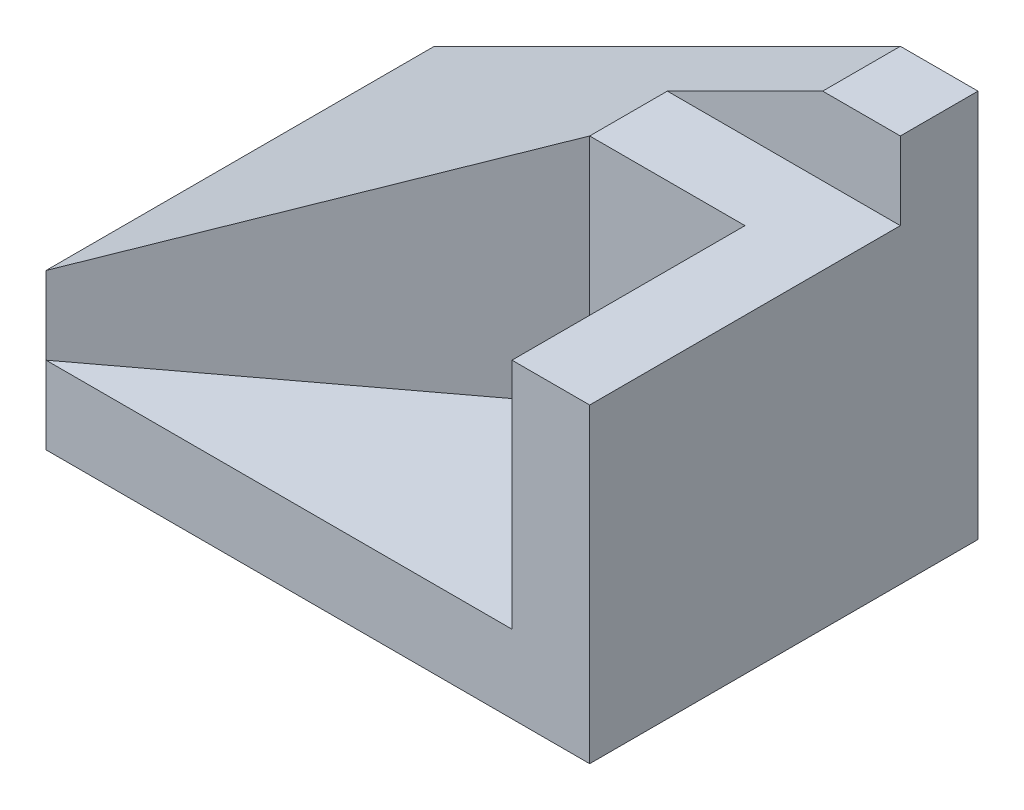
ISO-10303-21;
HEADER;
FILE_DESCRIPTION(('STEP AP214'),'2;1');
FILE_NAME('part.step','',(''),(''),'','','');
FILE_SCHEMA(('AUTOMOTIVE_DESIGN { 1 0 10303 214 1 1 1 1 }'));
ENDSEC;
DATA;
#1=APPLICATION_CONTEXT('core data for automotive mechanical design processes');
#2=APPLICATION_PROTOCOL_DEFINITION('international standard','automotive_design',2000,#1);
#3=PRODUCT_CONTEXT('',#1,'mechanical');
#4=PRODUCT('Part','Part','',(#3));
#5=PRODUCT_RELATED_PRODUCT_CATEGORY('part','',(#4));
#6=PRODUCT_DEFINITION_FORMATION('','',#4);
#7=PRODUCT_DEFINITION_CONTEXT('part definition',#1,'design');
#8=PRODUCT_DEFINITION('design','',#6,#7);
#9=PRODUCT_DEFINITION_SHAPE('','',#8);
#10=(LENGTH_UNIT() NAMED_UNIT(*) SI_UNIT(.MILLI.,.METRE.));
#11=(NAMED_UNIT(*) PLANE_ANGLE_UNIT() SI_UNIT($,.RADIAN.));
#12=(NAMED_UNIT(*) SI_UNIT($,.STERADIAN.) SOLID_ANGLE_UNIT());
#13=UNCERTAINTY_MEASURE_WITH_UNIT(LENGTH_MEASURE(1.E-05),#10,'distance_accuracy_value','');
#14=(GEOMETRIC_REPRESENTATION_CONTEXT(3) GLOBAL_UNCERTAINTY_ASSIGNED_CONTEXT((#13)) GLOBAL_UNIT_ASSIGNED_CONTEXT((#10,
#11,#12)) REPRESENTATION_CONTEXT('',''));
#15=CARTESIAN_POINT('',(0.,0.,0.));
#16=DIRECTION('',(0.,0.,1.));
#17=DIRECTION('',(1.,0.,0.));
#18=AXIS2_PLACEMENT_3D('',#15,#16,#17);
#19=CARTESIAN_POINT('',(0.,10.,20.));
#20=DIRECTION('',(0.,-1.,0.));
#21=DIRECTION('',(0.,0.,-1.));
#22=AXIS2_PLACEMENT_3D('',#19,#20,#21);
#23=PLANE('',#22);
#24=DIRECTION('',(-1.,0.,0.));
#25=VECTOR('',#24,1.);
#26=CARTESIAN_POINT('',(60.,10.,20.));
#27=LINE('',#26,#25);
#28=CARTESIAN_POINT('',(60.,10.,20.));
#29=VERTEX_POINT('',#28);
#30=CARTESIAN_POINT('',(40.,10.,20.));
#31=VERTEX_POINT('',#30);
#32=EDGE_CURVE('E171',#29,#31,#27,.T.);
#33=ORIENTED_EDGE('',*,*,#32,.T.);
#34=DIRECTION('',(0.8,0.,-0.6));
#35=VECTOR('',#34,1.);
#36=CARTESIAN_POINT('',(0.,10.,50.));
#37=LINE('',#36,#35);
#38=CARTESIAN_POINT('',(0.,10.,50.));
#39=VERTEX_POINT('',#38);
#40=EDGE_CURVE('E11',#39,#31,#37,.T.);
#41=ORIENTED_EDGE('',*,*,#40,.F.);
#42=DIRECTION('',(1.,0.,0.));
#43=VECTOR('',#42,1.);
#44=CARTESIAN_POINT('',(0.,10.,50.));
#45=LINE('',#44,#43);
#46=CARTESIAN_POINT('',(60.,10.,50.));
#47=VERTEX_POINT('',#46);
#48=EDGE_CURVE('E187',#39,#47,#45,.T.);
#49=ORIENTED_EDGE('',*,*,#48,.T.);
#50=DIRECTION('',(0.,0.,1.));
#51=VECTOR('',#50,1.);
#52=CARTESIAN_POINT('',(60.,10.,20.));
#53=LINE('',#52,#51);
#54=EDGE_CURVE('E126',#29,#47,#53,.T.);
#55=ORIENTED_EDGE('',*,*,#54,.F.);
#56=EDGE_LOOP('',(#33,#41,#49,#55));
#57=FACE_BOUND('',#56,.T.);
#58=ADVANCED_FACE('F33',(#57),#23,.F.);
#59=CARTESIAN_POINT('',(60.,50.,0.));
#60=DIRECTION('',(0.447213595499958,-0.894427190999916,0.));
#61=DIRECTION('',(0.894427190999916,0.447213595499958,0.));
#62=AXIS2_PLACEMENT_3D('',#59,#60,#61);
#63=PLANE('',#62);
#64=DIRECTION('',(0.,0.,1.));
#65=VECTOR('',#64,1.);
#66=CARTESIAN_POINT('',(0.,20.,0.));
#67=LINE('',#66,#65);
#68=CARTESIAN_POINT('',(0.,20.,0.));
#69=VERTEX_POINT('',#68);
#70=CARTESIAN_POINT('',(0.,20.,50.));
#71=VERTEX_POINT('',#70);
#72=EDGE_CURVE('E117',#69,#71,#67,.T.);
#73=ORIENTED_EDGE('',*,*,#72,.T.);
#74=DIRECTION('',(0.742781352708207,0.371390676354104,-0.557086014531156));
#75=VECTOR('',#74,1.);
#76=CARTESIAN_POINT('',(62.0689655172414,51.0344827586207,3.44827586206894));
#77=LINE('',#76,#75);
#78=CARTESIAN_POINT('',(40.,40.,20.));
#79=VERTEX_POINT('',#78);
#80=EDGE_CURVE('E104',#71,#79,#77,.T.);
#81=ORIENTED_EDGE('',*,*,#80,.T.);
#82=DIRECTION('',(0.,0.,-1.));
#83=VECTOR('',#82,1.);
#84=CARTESIAN_POINT('',(40.,40.,0.));
#85=LINE('',#84,#83);
#86=CARTESIAN_POINT('',(40.,40.,10.));
#87=VERTEX_POINT('',#86);
#88=EDGE_CURVE('E37',#79,#87,#85,.T.);
#89=ORIENTED_EDGE('',*,*,#88,.T.);
#90=DIRECTION('',(0.894427190999916,0.447213595499958,0.));
#91=VECTOR('',#90,1.);
#92=CARTESIAN_POINT('',(60.,50.,10.));
#93=LINE('',#92,#91);
#94=CARTESIAN_POINT('',(59.9999999999999,50.,10.));
#95=VERTEX_POINT('',#94);
#96=EDGE_CURVE('E132',#87,#95,#93,.T.);
#97=ORIENTED_EDGE('',*,*,#96,.T.);
#98=DIRECTION('',(0.,0.,1.));
#99=VECTOR('',#98,1.);
#100=CARTESIAN_POINT('',(60.,50.,0.));
#101=LINE('',#100,#99);
#102=CARTESIAN_POINT('',(60.,50.,0.));
#103=VERTEX_POINT('',#102);
#104=EDGE_CURVE('E158',#103,#95,#101,.T.);
#105=ORIENTED_EDGE('',*,*,#104,.F.);
#106=DIRECTION('',(0.894427190999916,0.447213595499958,0.));
#107=VECTOR('',#106,1.);
#108=CARTESIAN_POINT('',(60.,50.,0.));
#109=LINE('',#108,#107);
#110=EDGE_CURVE('E166',#69,#103,#109,.T.);
#111=ORIENTED_EDGE('',*,*,#110,.F.);
#112=EDGE_LOOP('',(#73,#81,#89,#97,#105,#111));
#113=FACE_BOUND('',#112,.T.);
#114=ADVANCED_FACE('F35',(#113),#63,.F.);
#115=CARTESIAN_POINT('',(20.,40.,50.));
#116=DIRECTION('',(0.,-1.,0.));
#117=DIRECTION('',(0.,0.,-1.));
#118=AXIS2_PLACEMENT_3D('',#115,#116,#117);
#119=PLANE('',#118);
#120=ORIENTED_EDGE('',*,*,#88,.F.);
#121=DIRECTION('',(-1.,0.,0.));
#122=VECTOR('',#121,1.);
#123=CARTESIAN_POINT('',(60.,40.,20.));
#124=LINE('',#123,#122);
#125=CARTESIAN_POINT('',(60.,40.,20.));
#126=VERTEX_POINT('',#125);
#127=EDGE_CURVE('E121',#126,#79,#124,.T.);
#128=ORIENTED_EDGE('',*,*,#127,.F.);
#129=DIRECTION('',(0.,0.,1.));
#130=VECTOR('',#129,1.);
#131=CARTESIAN_POINT('',(60.,40.,20.));
#132=LINE('',#131,#130);
#133=CARTESIAN_POINT('',(60.,40.,50.));
#134=VERTEX_POINT('',#133);
#135=EDGE_CURVE('E133',#126,#134,#132,.T.);
#136=ORIENTED_EDGE('',*,*,#135,.T.);
#137=DIRECTION('',(1.,0.,0.));
#138=VECTOR('',#137,1.);
#139=CARTESIAN_POINT('',(20.,40.,50.));
#140=LINE('',#139,#138);
#141=CARTESIAN_POINT('',(70.,40.,50.));
#142=VERTEX_POINT('',#141);
#143=EDGE_CURVE('E137',#134,#142,#140,.T.);
#144=ORIENTED_EDGE('',*,*,#143,.T.);
#145=DIRECTION('',(0.,0.,-1.));
#146=VECTOR('',#145,1.);
#147=CARTESIAN_POINT('',(70.,40.,50.));
#148=LINE('',#147,#146);
#149=CARTESIAN_POINT('',(70.,40.,10.));
#150=VERTEX_POINT('',#149);
#151=EDGE_CURVE('E162',#142,#150,#148,.T.);
#152=ORIENTED_EDGE('',*,*,#151,.T.);
#153=DIRECTION('',(1.,0.,0.));
#154=VECTOR('',#153,1.);
#155=CARTESIAN_POINT('',(20.,40.,10.));
#156=LINE('',#155,#154);
#157=EDGE_CURVE('E131',#87,#150,#156,.T.);
#158=ORIENTED_EDGE('',*,*,#157,.F.);
#159=EDGE_LOOP('',(#120,#128,#136,#144,#152,#158));
#160=FACE_BOUND('',#159,.T.);
#161=ADVANCED_FACE('F129',(#160),#119,.F.);
#162=CARTESIAN_POINT('',(0.,0.,50.));
#163=DIRECTION('',(1.,0.,0.));
#164=DIRECTION('',(0.,0.,-1.));
#165=AXIS2_PLACEMENT_3D('',#162,#163,#164);
#166=PLANE('',#165);
#167=DIRECTION('',(0.,-1.,0.));
#168=VECTOR('',#167,1.);
#169=CARTESIAN_POINT('',(0.,10.,50.));
#170=LINE('',#169,#168);
#171=EDGE_CURVE('E43',#71,#39,#170,.T.);
#172=ORIENTED_EDGE('',*,*,#171,.F.);
#173=ORIENTED_EDGE('',*,*,#72,.F.);
#174=DIRECTION('',(0.,-1.,0.));
#175=VECTOR('',#174,1.);
#176=CARTESIAN_POINT('',(0.,0.,0.));
#177=LINE('',#176,#175);
#178=CARTESIAN_POINT('',(0.,0.,0.));
#179=VERTEX_POINT('',#178);
#180=EDGE_CURVE('E160',#69,#179,#177,.T.);
#181=ORIENTED_EDGE('',*,*,#180,.T.);
#182=DIRECTION('',(0.,0.,-1.));
#183=VECTOR('',#182,1.);
#184=CARTESIAN_POINT('',(0.,0.,50.));
#185=LINE('',#184,#183);
#186=CARTESIAN_POINT('',(0.,0.,50.));
#187=VERTEX_POINT('',#186);
#188=EDGE_CURVE('E141',#187,#179,#185,.T.);
#189=ORIENTED_EDGE('',*,*,#188,.F.);
#190=DIRECTION('',(0.,-1.,0.));
#191=VECTOR('',#190,1.);
#192=CARTESIAN_POINT('',(0.,0.,50.));
#193=LINE('',#192,#191);
#194=EDGE_CURVE('E155',#39,#187,#193,.T.);
#195=ORIENTED_EDGE('',*,*,#194,.F.);
#196=EDGE_LOOP('',(#172,#173,#181,#189,#195));
#197=FACE_BOUND('',#196,.T.);
#198=ADVANCED_FACE('F291',(#197),#166,.F.);
#199=CARTESIAN_POINT('',(0.,0.,50.));
#200=DIRECTION('',(0.,1.,0.));
#201=DIRECTION('',(0.,0.,1.));
#202=AXIS2_PLACEMENT_3D('',#199,#200,#201);
#203=PLANE('',#202);
#204=DIRECTION('',(1.,0.,0.));
#205=VECTOR('',#204,1.);
#206=CARTESIAN_POINT('',(0.,0.,0.));
#207=LINE('',#206,#205);
#208=CARTESIAN_POINT('',(70.,0.,0.));
#209=VERTEX_POINT('',#208);
#210=EDGE_CURVE('E145',#179,#209,#207,.T.);
#211=ORIENTED_EDGE('',*,*,#210,.T.);
#212=DIRECTION('',(0.,0.,-1.));
#213=VECTOR('',#212,1.);
#214=CARTESIAN_POINT('',(70.,0.,50.));
#215=LINE('',#214,#213);
#216=CARTESIAN_POINT('',(70.,0.,50.));
#217=VERTEX_POINT('',#216);
#218=EDGE_CURVE('E144',#217,#209,#215,.T.);
#219=ORIENTED_EDGE('',*,*,#218,.F.);
#220=DIRECTION('',(1.,0.,0.));
#221=VECTOR('',#220,1.);
#222=CARTESIAN_POINT('',(0.,0.,50.));
#223=LINE('',#222,#221);
#224=EDGE_CURVE('E167',#187,#217,#223,.T.);
#225=ORIENTED_EDGE('',*,*,#224,.F.);
#226=ORIENTED_EDGE('',*,*,#188,.T.);
#227=EDGE_LOOP('',(#211,#219,#225,#226));
#228=FACE_BOUND('',#227,.T.);
#229=ADVANCED_FACE('F209',(#228),#203,.F.);
#230=CARTESIAN_POINT('',(70.,0.,50.));
#231=DIRECTION('',(-1.,0.,0.));
#232=DIRECTION('',(0.,0.,1.));
#233=AXIS2_PLACEMENT_3D('',#230,#231,#232);
#234=PLANE('',#233);
#235=DIRECTION('',(0.,0.,-1.));
#236=VECTOR('',#235,1.);
#237=CARTESIAN_POINT('',(70.,50.,50.));
#238=LINE('',#237,#236);
#239=CARTESIAN_POINT('',(70.,50.,10.));
#240=VERTEX_POINT('',#239);
#241=CARTESIAN_POINT('',(70.,50.,0.));
#242=VERTEX_POINT('',#241);
#243=EDGE_CURVE('E149',#240,#242,#238,.T.);
#244=ORIENTED_EDGE('',*,*,#243,.F.);
#245=DIRECTION('',(0.,1.,0.));
#246=VECTOR('',#245,1.);
#247=CARTESIAN_POINT('',(70.,50.,10.));
#248=LINE('',#247,#246);
#249=EDGE_CURVE('E177',#150,#240,#248,.T.);
#250=ORIENTED_EDGE('',*,*,#249,.F.);
#251=ORIENTED_EDGE('',*,*,#151,.F.);
#252=DIRECTION('',(0.,1.,0.));
#253=VECTOR('',#252,1.);
#254=CARTESIAN_POINT('',(70.,0.,50.));
#255=LINE('',#254,#253);
#256=EDGE_CURVE('E163',#217,#142,#255,.T.);
#257=ORIENTED_EDGE('',*,*,#256,.F.);
#258=ORIENTED_EDGE('',*,*,#218,.T.);
#259=DIRECTION('',(0.,1.,0.));
#260=VECTOR('',#259,1.);
#261=CARTESIAN_POINT('',(70.,0.,0.));
#262=LINE('',#261,#260);
#263=EDGE_CURVE('E148',#209,#242,#262,.T.);
#264=ORIENTED_EDGE('',*,*,#263,.T.);
#265=EDGE_LOOP('',(#244,#250,#251,#257,#258,#264));
#266=FACE_BOUND('',#265,.T.);
#267=ADVANCED_FACE('F203',(#266),#234,.F.);
#268=CARTESIAN_POINT('',(0.,50.,50.));
#269=DIRECTION('',(0.,-1.,0.));
#270=DIRECTION('',(0.,0.,-1.));
#271=AXIS2_PLACEMENT_3D('',#268,#269,#270);
#272=PLANE('',#271);
#273=ORIENTED_EDGE('',*,*,#104,.T.);
#274=DIRECTION('',(1.,0.,0.));
#275=VECTOR('',#274,1.);
#276=CARTESIAN_POINT('',(20.,50.,10.));
#277=LINE('',#276,#275);
#278=EDGE_CURVE('E152',#95,#240,#277,.T.);
#279=ORIENTED_EDGE('',*,*,#278,.T.);
#280=ORIENTED_EDGE('',*,*,#243,.T.);
#281=DIRECTION('',(-1.,0.,0.));
#282=VECTOR('',#281,1.);
#283=CARTESIAN_POINT('',(0.,50.,0.));
#284=LINE('',#283,#282);
#285=EDGE_CURVE('E151',#242,#103,#284,.T.);
#286=ORIENTED_EDGE('',*,*,#285,.T.);
#287=EDGE_LOOP('',(#273,#279,#280,#286));
#288=FACE_BOUND('',#287,.T.);
#289=ADVANCED_FACE('F217',(#288),#272,.F.);
#290=CARTESIAN_POINT('',(0.,0.,50.));
#291=DIRECTION('',(0.,0.,-1.));
#292=DIRECTION('',(-1.,0.,0.));
#293=AXIS2_PLACEMENT_3D('',#290,#291,#292);
#294=PLANE('',#293);
#295=DIRECTION('',(0.,1.,0.));
#296=VECTOR('',#295,1.);
#297=CARTESIAN_POINT('',(60.,0.,50.));
#298=LINE('',#297,#296);
#299=EDGE_CURVE('E181',#47,#134,#298,.T.);
#300=ORIENTED_EDGE('',*,*,#299,.F.);
#301=ORIENTED_EDGE('',*,*,#48,.F.);
#302=ORIENTED_EDGE('',*,*,#194,.T.);
#303=ORIENTED_EDGE('',*,*,#224,.T.);
#304=ORIENTED_EDGE('',*,*,#256,.T.);
#305=ORIENTED_EDGE('',*,*,#143,.F.);
#306=EDGE_LOOP('',(#300,#301,#302,#303,#304,#305));
#307=FACE_BOUND('',#306,.T.);
#308=ADVANCED_FACE('F204',(#307),#294,.F.);
#309=CARTESIAN_POINT('',(0.,0.,0.));
#310=DIRECTION('',(0.,0.,-1.));
#311=DIRECTION('',(-1.,0.,0.));
#312=AXIS2_PLACEMENT_3D('',#309,#310,#311);
#313=PLANE('',#312);
#314=ORIENTED_EDGE('',*,*,#110,.T.);
#315=ORIENTED_EDGE('',*,*,#285,.F.);
#316=ORIENTED_EDGE('',*,*,#263,.F.);
#317=ORIENTED_EDGE('',*,*,#210,.F.);
#318=ORIENTED_EDGE('',*,*,#180,.F.);
#319=EDGE_LOOP('',(#314,#315,#316,#317,#318));
#320=FACE_BOUND('',#319,.T.);
#321=ADVANCED_FACE('F214',(#320),#313,.T.);
#322=CARTESIAN_POINT('',(20.,50.,10.));
#323=DIRECTION('',(0.,0.,-1.));
#324=DIRECTION('',(0.,1.,0.));
#325=AXIS2_PLACEMENT_3D('',#322,#323,#324);
#326=PLANE('',#325);
#327=ORIENTED_EDGE('',*,*,#157,.T.);
#328=ORIENTED_EDGE('',*,*,#249,.T.);
#329=ORIENTED_EDGE('',*,*,#278,.F.);
#330=ORIENTED_EDGE('',*,*,#96,.F.);
#331=EDGE_LOOP('',(#327,#328,#329,#330));
#332=FACE_BOUND('',#331,.T.);
#333=ADVANCED_FACE('F219',(#332),#326,.F.);
#334=CARTESIAN_POINT('',(60.,0.,20.));
#335=DIRECTION('',(1.,0.,0.));
#336=DIRECTION('',(0.,0.,-1.));
#337=AXIS2_PLACEMENT_3D('',#334,#335,#336);
#338=PLANE('',#337);
#339=ORIENTED_EDGE('',*,*,#299,.T.);
#340=ORIENTED_EDGE('',*,*,#135,.F.);
#341=DIRECTION('',(0.,1.,0.));
#342=VECTOR('',#341,1.);
#343=CARTESIAN_POINT('',(60.,0.,20.));
#344=LINE('',#343,#342);
#345=EDGE_CURVE('E111',#29,#126,#344,.T.);
#346=ORIENTED_EDGE('',*,*,#345,.F.);
#347=ORIENTED_EDGE('',*,*,#54,.T.);
#348=EDGE_LOOP('',(#339,#340,#346,#347));
#349=FACE_BOUND('',#348,.T.);
#350=ADVANCED_FACE('F195',(#349),#338,.F.);
#351=CARTESIAN_POINT('',(60.,10.,20.));
#352=DIRECTION('',(0.,0.,-1.));
#353=DIRECTION('',(-1.,0.,0.));
#354=AXIS2_PLACEMENT_3D('',#351,#352,#353);
#355=PLANE('',#354);
#356=ORIENTED_EDGE('',*,*,#127,.T.);
#357=DIRECTION('',(0.,1.,0.));
#358=VECTOR('',#357,1.);
#359=CARTESIAN_POINT('',(40.,10.,20.));
#360=LINE('',#359,#358);
#361=EDGE_CURVE('E106',#31,#79,#360,.T.);
#362=ORIENTED_EDGE('',*,*,#361,.F.);
#363=ORIENTED_EDGE('',*,*,#32,.F.);
#364=ORIENTED_EDGE('',*,*,#345,.T.);
#365=EDGE_LOOP('',(#356,#362,#363,#364));
#366=FACE_BOUND('',#365,.T.);
#367=ADVANCED_FACE('F122',(#366),#355,.F.);
#368=CARTESIAN_POINT('',(24.,0.,32.));
#369=DIRECTION('',(-0.6,0.,-0.8));
#370=DIRECTION('',(-0.8,0.,0.6));
#371=AXIS2_PLACEMENT_3D('',#368,#369,#370);
#372=PLANE('',#371);
#373=ORIENTED_EDGE('',*,*,#361,.T.);
#374=ORIENTED_EDGE('',*,*,#80,.F.);
#375=ORIENTED_EDGE('',*,*,#171,.T.);
#376=ORIENTED_EDGE('',*,*,#40,.T.);
#377=EDGE_LOOP('',(#373,#374,#375,#376));
#378=FACE_BOUND('',#377,.T.);
#379=ADVANCED_FACE('F107',(#378),#372,.F.);
#380=CLOSED_SHELL('',(#58,#114,#161,#198,#229,#267,#289,#308,#321,#333,#350,#367,#379));
#381=MANIFOLD_SOLID_BREP('B2',#380);
#382=ADVANCED_BREP_SHAPE_REPRESENTATION('',(#18,#381),#14);
#383=SHAPE_DEFINITION_REPRESENTATION(#9,#382);
ENDSEC;
END-ISO-10303-21;
